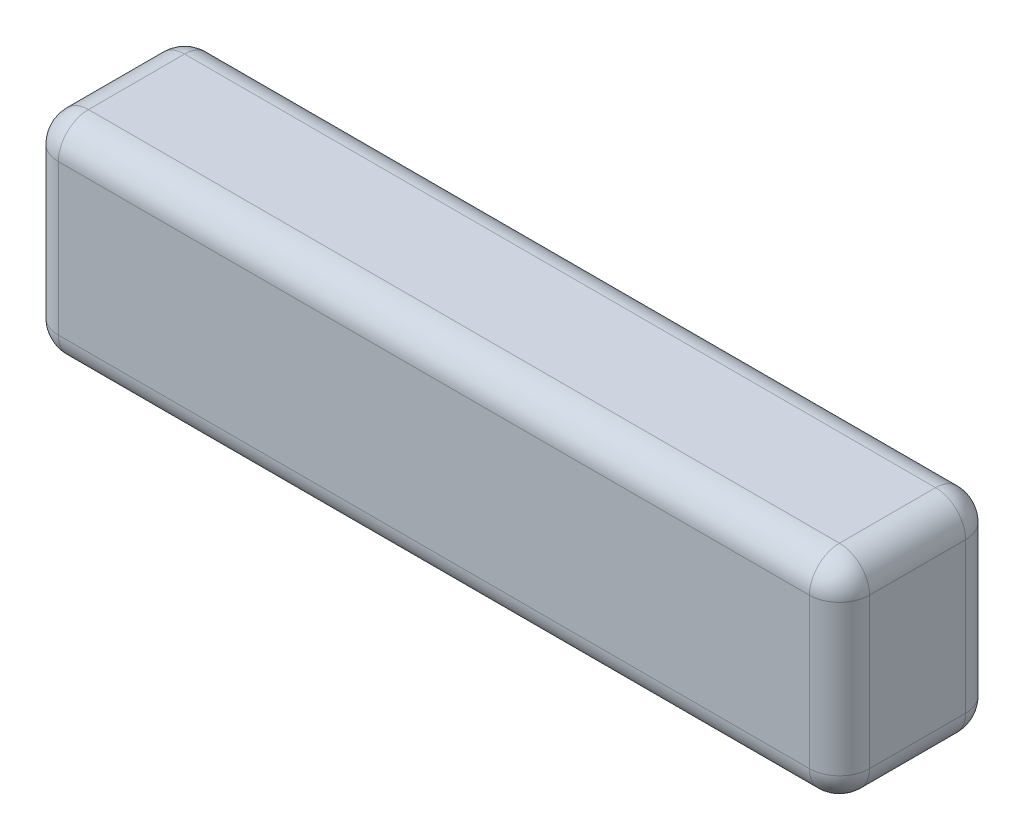
ISO-10303-21;
HEADER;
FILE_DESCRIPTION(('STEP AP214'),'2;1');
FILE_NAME('part.step','',(''),(''),'','','');
FILE_SCHEMA(('AUTOMOTIVE_DESIGN { 1 0 10303 214 1 1 1 1 }'));
ENDSEC;
DATA;
#1=APPLICATION_CONTEXT('core data for automotive mechanical design processes');
#2=APPLICATION_PROTOCOL_DEFINITION('international standard','automotive_design',2000,#1);
#3=PRODUCT_CONTEXT('',#1,'mechanical');
#4=PRODUCT('Part','Part','',(#3));
#5=PRODUCT_RELATED_PRODUCT_CATEGORY('part','',(#4));
#6=PRODUCT_DEFINITION_FORMATION('','',#4);
#7=PRODUCT_DEFINITION_CONTEXT('part definition',#1,'design');
#8=PRODUCT_DEFINITION('design','',#6,#7);
#9=PRODUCT_DEFINITION_SHAPE('','',#8);
#10=(LENGTH_UNIT() NAMED_UNIT(*) SI_UNIT(.MILLI.,.METRE.));
#11=(NAMED_UNIT(*) PLANE_ANGLE_UNIT() SI_UNIT($,.RADIAN.));
#12=(NAMED_UNIT(*) SI_UNIT($,.STERADIAN.) SOLID_ANGLE_UNIT());
#13=UNCERTAINTY_MEASURE_WITH_UNIT(LENGTH_MEASURE(1.E-05),#10,'distance_accuracy_value','');
#14=(GEOMETRIC_REPRESENTATION_CONTEXT(3) GLOBAL_UNCERTAINTY_ASSIGNED_CONTEXT((#13)) GLOBAL_UNIT_ASSIGNED_CONTEXT((#10,
#11,#12)) REPRESENTATION_CONTEXT('',''));
#15=CARTESIAN_POINT('',(0.,0.,0.));
#16=DIRECTION('',(0.,0.,1.));
#17=DIRECTION('',(1.,0.,0.));
#18=AXIS2_PLACEMENT_3D('',#15,#16,#17);
#19=CARTESIAN_POINT('',(135.,0.,26.));
#20=DIRECTION('',(0.,1.,0.));
#21=DIRECTION('',(-1.,0.,0.));
#22=AXIS2_PLACEMENT_3D('',#19,#20,#21);
#23=PLANE('',#22);
#24=DIRECTION('',(0.,0.,-1.));
#25=VECTOR('',#24,1.);
#26=CARTESIAN_POINT('',(5.00000000000003,0.,26.));
#27=LINE('',#26,#25);
#28=CARTESIAN_POINT('',(5.00000000000003,0.,21.));
#29=VERTEX_POINT('',#28);
#30=CARTESIAN_POINT('',(5.00000000000003,0.,5.));
#31=VERTEX_POINT('',#30);
#32=EDGE_CURVE('E189',#29,#31,#27,.T.);
#33=ORIENTED_EDGE('',*,*,#32,.T.);
#34=DIRECTION('',(1.,0.,0.));
#35=VECTOR('',#34,1.);
#36=CARTESIAN_POINT('',(135.,0.,5.));
#37=LINE('',#36,#35);
#38=CARTESIAN_POINT('',(130.,0.,5.));
#39=VERTEX_POINT('',#38);
#40=EDGE_CURVE('E191',#31,#39,#37,.T.);
#41=ORIENTED_EDGE('',*,*,#40,.T.);
#42=DIRECTION('',(0.,0.,-1.));
#43=VECTOR('',#42,1.);
#44=CARTESIAN_POINT('',(130.,0.,26.));
#45=LINE('',#44,#43);
#46=CARTESIAN_POINT('',(130.,0.,21.));
#47=VERTEX_POINT('',#46);
#48=EDGE_CURVE('E187',#39,#47,#45,.F.);
#49=ORIENTED_EDGE('',*,*,#48,.T.);
#50=DIRECTION('',(1.,0.,0.));
#51=VECTOR('',#50,1.);
#52=CARTESIAN_POINT('',(135.,0.,21.));
#53=LINE('',#52,#51);
#54=EDGE_CURVE('E185',#47,#29,#53,.F.);
#55=ORIENTED_EDGE('',*,*,#54,.T.);
#56=EDGE_LOOP('',(#33,#41,#49,#55));
#57=FACE_BOUND('',#56,.T.);
#58=ADVANCED_FACE('F32',(#57),#23,.F.);
#59=CARTESIAN_POINT('',(135.,35.,26.));
#60=DIRECTION('',(-1.,0.,0.));
#61=DIRECTION('',(0.,0.,1.));
#62=AXIS2_PLACEMENT_3D('',#59,#60,#61);
#63=PLANE('',#62);
#64=DIRECTION('',(0.,0.,-1.));
#65=VECTOR('',#64,1.);
#66=CARTESIAN_POINT('',(135.,5.00000000000001,26.));
#67=LINE('',#66,#65);
#68=CARTESIAN_POINT('',(135.,5.00000000000001,21.));
#69=VERTEX_POINT('',#68);
#70=CARTESIAN_POINT('',(135.,5.00000000000001,5.));
#71=VERTEX_POINT('',#70);
#72=EDGE_CURVE('E154',#69,#71,#67,.T.);
#73=ORIENTED_EDGE('',*,*,#72,.T.);
#74=DIRECTION('',(0.,1.,0.));
#75=VECTOR('',#74,1.);
#76=CARTESIAN_POINT('',(135.,35.,5.));
#77=LINE('',#76,#75);
#78=CARTESIAN_POINT('',(135.,30.,5.));
#79=VERTEX_POINT('',#78);
#80=EDGE_CURVE('E126',#71,#79,#77,.T.);
#81=ORIENTED_EDGE('',*,*,#80,.T.);
#82=DIRECTION('',(0.,0.,-1.));
#83=VECTOR('',#82,1.);
#84=CARTESIAN_POINT('',(135.,30.,26.));
#85=LINE('',#84,#83);
#86=CARTESIAN_POINT('',(135.,30.,21.));
#87=VERTEX_POINT('',#86);
#88=EDGE_CURVE('E144',#79,#87,#85,.F.);
#89=ORIENTED_EDGE('',*,*,#88,.T.);
#90=DIRECTION('',(0.,1.,0.));
#91=VECTOR('',#90,1.);
#92=CARTESIAN_POINT('',(135.,35.,21.));
#93=LINE('',#92,#91);
#94=EDGE_CURVE('E150',#87,#69,#93,.F.);
#95=ORIENTED_EDGE('',*,*,#94,.T.);
#96=EDGE_LOOP('',(#73,#81,#89,#95));
#97=FACE_BOUND('',#96,.T.);
#98=ADVANCED_FACE('F152',(#97),#63,.F.);
#99=CARTESIAN_POINT('',(0.,35.,26.));
#100=DIRECTION('',(0.,-1.,0.));
#101=DIRECTION('',(0.,0.,-1.));
#102=AXIS2_PLACEMENT_3D('',#99,#100,#101);
#103=PLANE('',#102);
#104=DIRECTION('',(0.,0.,-1.));
#105=VECTOR('',#104,1.);
#106=CARTESIAN_POINT('',(130.,35.,26.));
#107=LINE('',#106,#105);
#108=CARTESIAN_POINT('',(130.,35.,21.));
#109=VERTEX_POINT('',#108);
#110=CARTESIAN_POINT('',(130.,35.,5.));
#111=VERTEX_POINT('',#110);
#112=EDGE_CURVE('E167',#109,#111,#107,.T.);
#113=ORIENTED_EDGE('',*,*,#112,.T.);
#114=DIRECTION('',(-1.,0.,0.));
#115=VECTOR('',#114,1.);
#116=CARTESIAN_POINT('',(0.,35.,5.));
#117=LINE('',#116,#115);
#118=CARTESIAN_POINT('',(5.,35.,5.));
#119=VERTEX_POINT('',#118);
#120=EDGE_CURVE('E173',#111,#119,#117,.T.);
#121=ORIENTED_EDGE('',*,*,#120,.T.);
#122=DIRECTION('',(0.,0.,-1.));
#123=VECTOR('',#122,1.);
#124=CARTESIAN_POINT('',(5.,35.,26.));
#125=LINE('',#124,#123);
#126=CARTESIAN_POINT('',(5.,35.,21.));
#127=VERTEX_POINT('',#126);
#128=EDGE_CURVE('E171',#119,#127,#125,.F.);
#129=ORIENTED_EDGE('',*,*,#128,.T.);
#130=DIRECTION('',(-1.,0.,0.));
#131=VECTOR('',#130,1.);
#132=CARTESIAN_POINT('',(0.,35.,21.));
#133=LINE('',#132,#131);
#134=EDGE_CURVE('E169',#127,#109,#133,.F.);
#135=ORIENTED_EDGE('',*,*,#134,.T.);
#136=EDGE_LOOP('',(#113,#121,#129,#135));
#137=FACE_BOUND('',#136,.T.);
#138=ADVANCED_FACE('F289',(#137),#103,.F.);
#139=CARTESIAN_POINT('',(0.,0.,26.));
#140=DIRECTION('',(1.,0.,0.));
#141=DIRECTION('',(0.,0.,-1.));
#142=AXIS2_PLACEMENT_3D('',#139,#140,#141);
#143=PLANE('',#142);
#144=DIRECTION('',(0.,0.,-1.));
#145=VECTOR('',#144,1.);
#146=CARTESIAN_POINT('',(0.,30.,26.));
#147=LINE('',#146,#145);
#148=CARTESIAN_POINT('',(0.,30.,21.));
#149=VERTEX_POINT('',#148);
#150=CARTESIAN_POINT('',(0.,30.,5.));
#151=VERTEX_POINT('',#150);
#152=EDGE_CURVE('E176',#149,#151,#147,.T.);
#153=ORIENTED_EDGE('',*,*,#152,.T.);
#154=DIRECTION('',(0.,-1.,0.));
#155=VECTOR('',#154,1.);
#156=CARTESIAN_POINT('',(0.,0.,5.));
#157=LINE('',#156,#155);
#158=CARTESIAN_POINT('',(0.,5.,5.));
#159=VERTEX_POINT('',#158);
#160=EDGE_CURVE('E182',#151,#159,#157,.T.);
#161=ORIENTED_EDGE('',*,*,#160,.T.);
#162=DIRECTION('',(0.,0.,-1.));
#163=VECTOR('',#162,1.);
#164=CARTESIAN_POINT('',(0.,5.,26.));
#165=LINE('',#164,#163);
#166=CARTESIAN_POINT('',(0.,5.,21.));
#167=VERTEX_POINT('',#166);
#168=EDGE_CURVE('E180',#159,#167,#165,.F.);
#169=ORIENTED_EDGE('',*,*,#168,.T.);
#170=DIRECTION('',(0.,-1.,0.));
#171=VECTOR('',#170,1.);
#172=CARTESIAN_POINT('',(0.,0.,21.));
#173=LINE('',#172,#171);
#174=EDGE_CURVE('E178',#167,#149,#173,.F.);
#175=ORIENTED_EDGE('',*,*,#174,.T.);
#176=EDGE_LOOP('',(#153,#161,#169,#175));
#177=FACE_BOUND('',#176,.T.);
#178=ADVANCED_FACE('F352',(#177),#143,.F.);
#179=CARTESIAN_POINT('',(0.,0.,26.));
#180=DIRECTION('',(0.,0.,-1.));
#181=DIRECTION('',(-1.,0.,0.));
#182=AXIS2_PLACEMENT_3D('',#179,#180,#181);
#183=PLANE('',#182);
#184=DIRECTION('',(-1.,0.,0.));
#185=VECTOR('',#184,1.);
#186=CARTESIAN_POINT('',(0.,30.,26.));
#187=LINE('',#186,#185);
#188=CARTESIAN_POINT('',(130.,30.,26.));
#189=VERTEX_POINT('',#188);
#190=CARTESIAN_POINT('',(5.,30.,26.));
#191=VERTEX_POINT('',#190);
#192=EDGE_CURVE('E194',#189,#191,#187,.T.);
#193=ORIENTED_EDGE('',*,*,#192,.T.);
#194=DIRECTION('',(0.,-1.,0.));
#195=VECTOR('',#194,1.);
#196=CARTESIAN_POINT('',(5.,0.,26.));
#197=LINE('',#196,#195);
#198=CARTESIAN_POINT('',(5.,5.,26.));
#199=VERTEX_POINT('',#198);
#200=EDGE_CURVE('E11',#191,#199,#197,.T.);
#201=ORIENTED_EDGE('',*,*,#200,.T.);
#202=DIRECTION('',(1.,0.,0.));
#203=VECTOR('',#202,1.);
#204=CARTESIAN_POINT('',(0.,5.,26.));
#205=LINE('',#204,#203);
#206=CARTESIAN_POINT('',(130.,5.00000000000001,26.));
#207=VERTEX_POINT('',#206);
#208=EDGE_CURVE('E41',#199,#207,#205,.T.);
#209=ORIENTED_EDGE('',*,*,#208,.T.);
#210=DIRECTION('',(0.,1.,0.));
#211=VECTOR('',#210,1.);
#212=CARTESIAN_POINT('',(130.,0.,26.));
#213=LINE('',#212,#211);
#214=EDGE_CURVE('E196',#207,#189,#213,.T.);
#215=ORIENTED_EDGE('',*,*,#214,.T.);
#216=EDGE_LOOP('',(#193,#201,#209,#215));
#217=FACE_BOUND('',#216,.T.);
#218=ADVANCED_FACE('F362',(#217),#183,.F.);
#219=CARTESIAN_POINT('',(0.,0.,0.));
#220=DIRECTION('',(0.,0.,-1.));
#221=DIRECTION('',(-1.,0.,0.));
#222=AXIS2_PLACEMENT_3D('',#219,#220,#221);
#223=PLANE('',#222);
#224=DIRECTION('',(-1.,0.,0.));
#225=VECTOR('',#224,1.);
#226=CARTESIAN_POINT('',(135.,30.,0.));
#227=LINE('',#226,#225);
#228=CARTESIAN_POINT('',(5.,30.,0.));
#229=VERTEX_POINT('',#228);
#230=CARTESIAN_POINT('',(130.,30.,0.));
#231=VERTEX_POINT('',#230);
#232=EDGE_CURVE('E164',#229,#231,#227,.F.);
#233=ORIENTED_EDGE('',*,*,#232,.T.);
#234=DIRECTION('',(0.,1.,0.));
#235=VECTOR('',#234,1.);
#236=CARTESIAN_POINT('',(130.,0.,0.));
#237=LINE('',#236,#235);
#238=CARTESIAN_POINT('',(130.,5.00000000000001,0.));
#239=VERTEX_POINT('',#238);
#240=EDGE_CURVE('E128',#231,#239,#237,.F.);
#241=ORIENTED_EDGE('',*,*,#240,.T.);
#242=DIRECTION('',(1.,0.,0.));
#243=VECTOR('',#242,1.);
#244=CARTESIAN_POINT('',(0.,5.,0.));
#245=LINE('',#244,#243);
#246=CARTESIAN_POINT('',(5.,5.,0.));
#247=VERTEX_POINT('',#246);
#248=EDGE_CURVE('E156',#239,#247,#245,.F.);
#249=ORIENTED_EDGE('',*,*,#248,.T.);
#250=DIRECTION('',(0.,-1.,0.));
#251=VECTOR('',#250,1.);
#252=CARTESIAN_POINT('',(5.,35.,0.));
#253=LINE('',#252,#251);
#254=EDGE_CURVE('E158',#247,#229,#253,.F.);
#255=ORIENTED_EDGE('',*,*,#254,.T.);
#256=EDGE_LOOP('',(#233,#241,#249,#255));
#257=FACE_BOUND('',#256,.T.);
#258=ADVANCED_FACE('F364',(#257),#223,.T.);
#259=CARTESIAN_POINT('',(5.,0.,21.));
#260=DIRECTION('',(0.,-1.,0.));
#261=DIRECTION('',(0.,0.,-1.));
#262=AXIS2_PLACEMENT_3D('',#259,#260,#261);
#263=CYLINDRICAL_SURFACE('',#262,5.);
#264=CARTESIAN_POINT('',(5.,5.,21.));
#265=DIRECTION('',(0.,-1.,0.));
#266=DIRECTION('',(0.,0.,-1.));
#267=AXIS2_PLACEMENT_3D('',#264,#265,#266);
#268=CIRCLE('',#267,5.);
#269=EDGE_CURVE('E36',#199,#167,#268,.T.);
#270=ORIENTED_EDGE('',*,*,#269,.F.);
#271=ORIENTED_EDGE('',*,*,#200,.F.);
#272=CARTESIAN_POINT('',(5.,30.,21.));
#273=DIRECTION('',(0.,1.,0.));
#274=DIRECTION('',(0.,0.,1.));
#275=AXIS2_PLACEMENT_3D('',#272,#273,#274);
#276=CIRCLE('',#275,5.);
#277=EDGE_CURVE('E247',#149,#191,#276,.T.);
#278=ORIENTED_EDGE('',*,*,#277,.F.);
#279=ORIENTED_EDGE('',*,*,#174,.F.);
#280=EDGE_LOOP('',(#270,#271,#278,#279));
#281=FACE_BOUND('',#280,.T.);
#282=ADVANCED_FACE('F34',(#281),#263,.T.);
#283=CARTESIAN_POINT('',(5.,5.,21.));
#284=DIRECTION('',(0.,0.,1.));
#285=DIRECTION('',(1.,0.,0.));
#286=AXIS2_PLACEMENT_3D('',#283,#284,#285);
#287=SPHERICAL_SURFACE('',#286,5.);
#288=CARTESIAN_POINT('',(5.00000000000003,5.,21.));
#289=DIRECTION('',(-1.,0.,0.));
#290=DIRECTION('',(0.,0.,1.));
#291=AXIS2_PLACEMENT_3D('',#288,#289,#290);
#292=CIRCLE('',#291,5.);
#293=EDGE_CURVE('E243',#199,#29,#292,.F.);
#294=ORIENTED_EDGE('',*,*,#293,.F.);
#295=ORIENTED_EDGE('',*,*,#269,.T.);
#296=CARTESIAN_POINT('',(5.,5.,21.));
#297=DIRECTION('',(0.,0.,1.));
#298=DIRECTION('',(1.,0.,0.));
#299=AXIS2_PLACEMENT_3D('',#296,#297,#298);
#300=CIRCLE('',#299,5.);
#301=EDGE_CURVE('E245',#29,#167,#300,.F.);
#302=ORIENTED_EDGE('',*,*,#301,.F.);
#303=EDGE_LOOP('',(#294,#295,#302));
#304=FACE_BOUND('',#303,.T.);
#305=ADVANCED_FACE('F257',(#304),#287,.T.);
#306=CARTESIAN_POINT('',(5.,30.,21.));
#307=DIRECTION('',(0.,0.,1.));
#308=DIRECTION('',(1.,0.,0.));
#309=AXIS2_PLACEMENT_3D('',#306,#307,#308);
#310=SPHERICAL_SURFACE('',#309,5.);
#311=CARTESIAN_POINT('',(5.,30.,21.));
#312=DIRECTION('',(0.,0.,1.));
#313=DIRECTION('',(1.,0.,0.));
#314=AXIS2_PLACEMENT_3D('',#311,#312,#313);
#315=CIRCLE('',#314,5.);
#316=EDGE_CURVE('E237',#149,#127,#315,.F.);
#317=ORIENTED_EDGE('',*,*,#316,.F.);
#318=ORIENTED_EDGE('',*,*,#277,.T.);
#319=CARTESIAN_POINT('',(5.,30.,21.));
#320=DIRECTION('',(-1.,0.,0.));
#321=DIRECTION('',(0.,0.,1.));
#322=AXIS2_PLACEMENT_3D('',#319,#320,#321);
#323=CIRCLE('',#322,5.);
#324=EDGE_CURVE('E240',#127,#191,#323,.F.);
#325=ORIENTED_EDGE('',*,*,#324,.F.);
#326=EDGE_LOOP('',(#317,#318,#325));
#327=FACE_BOUND('',#326,.T.);
#328=ADVANCED_FACE('F282',(#327),#310,.T.);
#329=CARTESIAN_POINT('',(5.00000000000003,5.,26.));
#330=DIRECTION('',(0.,0.,-1.));
#331=DIRECTION('',(-1.,0.,0.));
#332=AXIS2_PLACEMENT_3D('',#329,#330,#331);
#333=CYLINDRICAL_SURFACE('',#332,5.);
#334=ORIENTED_EDGE('',*,*,#301,.T.);
#335=ORIENTED_EDGE('',*,*,#168,.F.);
#336=CARTESIAN_POINT('',(5.00000000000003,5.,5.));
#337=DIRECTION('',(0.,0.,-1.));
#338=DIRECTION('',(-1.,0.,0.));
#339=AXIS2_PLACEMENT_3D('',#336,#337,#338);
#340=CIRCLE('',#339,5.);
#341=EDGE_CURVE('E232',#31,#159,#340,.T.);
#342=ORIENTED_EDGE('',*,*,#341,.F.);
#343=ORIENTED_EDGE('',*,*,#32,.F.);
#344=EDGE_LOOP('',(#334,#335,#342,#343));
#345=FACE_BOUND('',#344,.T.);
#346=ADVANCED_FACE('F264',(#345),#333,.T.);
#347=CARTESIAN_POINT('',(0.,5.,21.));
#348=DIRECTION('',(1.,0.,0.));
#349=DIRECTION('',(0.,1.,0.));
#350=AXIS2_PLACEMENT_3D('',#347,#348,#349);
#351=CYLINDRICAL_SURFACE('',#350,5.);
#352=ORIENTED_EDGE('',*,*,#293,.T.);
#353=ORIENTED_EDGE('',*,*,#54,.F.);
#354=CARTESIAN_POINT('',(130.,5.00000000000001,21.));
#355=DIRECTION('',(1.,0.,0.));
#356=DIRECTION('',(0.,0.,-1.));
#357=AXIS2_PLACEMENT_3D('',#354,#355,#356);
#358=CIRCLE('',#357,5.);
#359=EDGE_CURVE('E229',#207,#47,#358,.T.);
#360=ORIENTED_EDGE('',*,*,#359,.F.);
#361=ORIENTED_EDGE('',*,*,#208,.F.);
#362=EDGE_LOOP('',(#352,#353,#360,#361));
#363=FACE_BOUND('',#362,.T.);
#364=ADVANCED_FACE('F271',(#363),#351,.T.);
#365=CARTESIAN_POINT('',(130.,0.,21.));
#366=DIRECTION('',(0.,1.,0.));
#367=DIRECTION('',(0.,0.,1.));
#368=AXIS2_PLACEMENT_3D('',#365,#366,#367);
#369=CYLINDRICAL_SURFACE('',#368,5.);
#370=CARTESIAN_POINT('',(130.,30.,21.));
#371=DIRECTION('',(0.,1.,0.));
#372=DIRECTION('',(0.,0.,1.));
#373=AXIS2_PLACEMENT_3D('',#370,#371,#372);
#374=CIRCLE('',#373,5.);
#375=EDGE_CURVE('E223',#189,#87,#374,.T.);
#376=ORIENTED_EDGE('',*,*,#375,.F.);
#377=ORIENTED_EDGE('',*,*,#214,.F.);
#378=CARTESIAN_POINT('',(130.,5.00000000000001,21.));
#379=DIRECTION('',(0.,-1.,0.));
#380=DIRECTION('',(0.,0.,-1.));
#381=AXIS2_PLACEMENT_3D('',#378,#379,#380);
#382=CIRCLE('',#381,5.);
#383=EDGE_CURVE('E226',#69,#207,#382,.T.);
#384=ORIENTED_EDGE('',*,*,#383,.F.);
#385=ORIENTED_EDGE('',*,*,#94,.F.);
#386=EDGE_LOOP('',(#376,#377,#384,#385));
#387=FACE_BOUND('',#386,.T.);
#388=ADVANCED_FACE('F273',(#387),#369,.T.);
#389=CARTESIAN_POINT('',(0.,30.,21.));
#390=DIRECTION('',(-1.,0.,0.));
#391=DIRECTION('',(0.,0.,1.));
#392=AXIS2_PLACEMENT_3D('',#389,#390,#391);
#393=CYLINDRICAL_SURFACE('',#392,5.);
#394=ORIENTED_EDGE('',*,*,#324,.T.);
#395=ORIENTED_EDGE('',*,*,#192,.F.);
#396=CARTESIAN_POINT('',(130.,30.,21.));
#397=DIRECTION('',(1.,0.,0.));
#398=DIRECTION('',(0.,0.,-1.));
#399=AXIS2_PLACEMENT_3D('',#396,#397,#398);
#400=CIRCLE('',#399,5.);
#401=EDGE_CURVE('E220',#109,#189,#400,.T.);
#402=ORIENTED_EDGE('',*,*,#401,.F.);
#403=ORIENTED_EDGE('',*,*,#134,.F.);
#404=EDGE_LOOP('',(#394,#395,#402,#403));
#405=FACE_BOUND('',#404,.T.);
#406=ADVANCED_FACE('F279',(#405),#393,.T.);
#407=CARTESIAN_POINT('',(5.,30.,26.));
#408=DIRECTION('',(0.,0.,-1.));
#409=DIRECTION('',(-1.,0.,0.));
#410=AXIS2_PLACEMENT_3D('',#407,#408,#409);
#411=CYLINDRICAL_SURFACE('',#410,5.);
#412=ORIENTED_EDGE('',*,*,#316,.T.);
#413=ORIENTED_EDGE('',*,*,#128,.F.);
#414=CARTESIAN_POINT('',(5.,30.,5.));
#415=DIRECTION('',(0.,0.,-1.));
#416=DIRECTION('',(-1.,0.,0.));
#417=AXIS2_PLACEMENT_3D('',#414,#415,#416);
#418=CIRCLE('',#417,5.);
#419=EDGE_CURVE('E217',#151,#119,#418,.T.);
#420=ORIENTED_EDGE('',*,*,#419,.F.);
#421=ORIENTED_EDGE('',*,*,#152,.F.);
#422=EDGE_LOOP('',(#412,#413,#420,#421));
#423=FACE_BOUND('',#422,.T.);
#424=ADVANCED_FACE('F334',(#423),#411,.T.);
#425=CARTESIAN_POINT('',(5.,0.,5.));
#426=DIRECTION('',(0.,1.,0.));
#427=DIRECTION('',(0.,0.,1.));
#428=AXIS2_PLACEMENT_3D('',#425,#426,#427);
#429=CYLINDRICAL_SURFACE('',#428,5.);
#430=CARTESIAN_POINT('',(5.,5.,5.));
#431=DIRECTION('',(0.,-1.,0.));
#432=DIRECTION('',(0.,0.,-1.));
#433=AXIS2_PLACEMENT_3D('',#430,#431,#432);
#434=CIRCLE('',#433,5.);
#435=EDGE_CURVE('E234',#159,#247,#434,.T.);
#436=ORIENTED_EDGE('',*,*,#435,.F.);
#437=ORIENTED_EDGE('',*,*,#160,.F.);
#438=CARTESIAN_POINT('',(5.,30.,5.));
#439=DIRECTION('',(0.,1.,0.));
#440=DIRECTION('',(0.,0.,1.));
#441=AXIS2_PLACEMENT_3D('',#438,#439,#440);
#442=CIRCLE('',#441,5.);
#443=EDGE_CURVE('E214',#229,#151,#442,.T.);
#444=ORIENTED_EDGE('',*,*,#443,.F.);
#445=ORIENTED_EDGE('',*,*,#254,.F.);
#446=EDGE_LOOP('',(#436,#437,#444,#445));
#447=FACE_BOUND('',#446,.T.);
#448=ADVANCED_FACE('F330',(#447),#429,.T.);
#449=CARTESIAN_POINT('',(5.,5.,5.));
#450=DIRECTION('',(0.,0.,1.));
#451=DIRECTION('',(1.,0.,0.));
#452=AXIS2_PLACEMENT_3D('',#449,#450,#451);
#453=SPHERICAL_SURFACE('',#452,5.);
#454=ORIENTED_EDGE('',*,*,#341,.T.);
#455=ORIENTED_EDGE('',*,*,#435,.T.);
#456=CARTESIAN_POINT('',(5.,5.,5.));
#457=DIRECTION('',(-1.,0.,0.));
#458=DIRECTION('',(0.,-1.,0.));
#459=AXIS2_PLACEMENT_3D('',#456,#457,#458);
#460=CIRCLE('',#459,5.);
#461=EDGE_CURVE('E211',#31,#247,#460,.F.);
#462=ORIENTED_EDGE('',*,*,#461,.F.);
#463=EDGE_LOOP('',(#454,#455,#462));
#464=FACE_BOUND('',#463,.T.);
#465=ADVANCED_FACE('F326',(#464),#453,.T.);
#466=CARTESIAN_POINT('',(130.,5.00000000000001,21.));
#467=DIRECTION('',(0.,0.,1.));
#468=DIRECTION('',(1.,0.,0.));
#469=AXIS2_PLACEMENT_3D('',#466,#467,#468);
#470=SPHERICAL_SURFACE('',#469,5.);
#471=ORIENTED_EDGE('',*,*,#383,.T.);
#472=ORIENTED_EDGE('',*,*,#359,.T.);
#473=CARTESIAN_POINT('',(130.,5.00000000000001,21.));
#474=DIRECTION('',(0.,0.,1.));
#475=DIRECTION('',(1.,0.,0.));
#476=AXIS2_PLACEMENT_3D('',#473,#474,#475);
#477=CIRCLE('',#476,5.);
#478=EDGE_CURVE('E208',#69,#47,#477,.F.);
#479=ORIENTED_EDGE('',*,*,#478,.F.);
#480=EDGE_LOOP('',(#471,#472,#479));
#481=FACE_BOUND('',#480,.T.);
#482=ADVANCED_FACE('F322',(#481),#470,.T.);
#483=CARTESIAN_POINT('',(130.,30.,21.));
#484=DIRECTION('',(0.,0.,1.));
#485=DIRECTION('',(1.,0.,0.));
#486=AXIS2_PLACEMENT_3D('',#483,#484,#485);
#487=SPHERICAL_SURFACE('',#486,5.);
#488=ORIENTED_EDGE('',*,*,#401,.T.);
#489=ORIENTED_EDGE('',*,*,#375,.T.);
#490=CARTESIAN_POINT('',(130.,30.,21.));
#491=DIRECTION('',(0.,0.,1.));
#492=DIRECTION('',(1.,0.,0.));
#493=AXIS2_PLACEMENT_3D('',#490,#491,#492);
#494=CIRCLE('',#493,5.);
#495=EDGE_CURVE('E147',#109,#87,#494,.F.);
#496=ORIENTED_EDGE('',*,*,#495,.F.);
#497=EDGE_LOOP('',(#488,#489,#496));
#498=FACE_BOUND('',#497,.T.);
#499=ADVANCED_FACE('F318',(#498),#487,.T.);
#500=CARTESIAN_POINT('',(5.,30.,5.));
#501=DIRECTION('',(0.,0.,1.));
#502=DIRECTION('',(1.,0.,0.));
#503=AXIS2_PLACEMENT_3D('',#500,#501,#502);
#504=SPHERICAL_SURFACE('',#503,5.);
#505=ORIENTED_EDGE('',*,*,#443,.T.);
#506=ORIENTED_EDGE('',*,*,#419,.T.);
#507=CARTESIAN_POINT('',(5.,30.,5.));
#508=DIRECTION('',(-1.,0.,0.));
#509=DIRECTION('',(0.,0.,1.));
#510=AXIS2_PLACEMENT_3D('',#507,#508,#509);
#511=CIRCLE('',#510,5.);
#512=EDGE_CURVE('E205',#229,#119,#511,.F.);
#513=ORIENTED_EDGE('',*,*,#512,.F.);
#514=EDGE_LOOP('',(#505,#506,#513));
#515=FACE_BOUND('',#514,.T.);
#516=ADVANCED_FACE('F314',(#515),#504,.T.);
#517=CARTESIAN_POINT('',(135.,5.00000000000001,5.));
#518=DIRECTION('',(-1.,0.,0.));
#519=DIRECTION('',(0.,-1.,0.));
#520=AXIS2_PLACEMENT_3D('',#517,#518,#519);
#521=CYLINDRICAL_SURFACE('',#520,5.);
#522=ORIENTED_EDGE('',*,*,#461,.T.);
#523=ORIENTED_EDGE('',*,*,#248,.F.);
#524=CARTESIAN_POINT('',(130.,5.00000000000001,5.));
#525=DIRECTION('',(1.,0.,0.));
#526=DIRECTION('',(0.,0.,-1.));
#527=AXIS2_PLACEMENT_3D('',#524,#525,#526);
#528=CIRCLE('',#527,5.);
#529=EDGE_CURVE('E202',#39,#239,#528,.T.);
#530=ORIENTED_EDGE('',*,*,#529,.F.);
#531=ORIENTED_EDGE('',*,*,#40,.F.);
#532=EDGE_LOOP('',(#522,#523,#530,#531));
#533=FACE_BOUND('',#532,.T.);
#534=ADVANCED_FACE('F310',(#533),#521,.T.);
#535=CARTESIAN_POINT('',(130.,5.00000000000001,26.));
#536=DIRECTION('',(0.,0.,-1.));
#537=DIRECTION('',(-1.,0.,0.));
#538=AXIS2_PLACEMENT_3D('',#535,#536,#537);
#539=CYLINDRICAL_SURFACE('',#538,5.);
#540=ORIENTED_EDGE('',*,*,#478,.T.);
#541=ORIENTED_EDGE('',*,*,#48,.F.);
#542=CARTESIAN_POINT('',(130.,5.00000000000001,5.));
#543=DIRECTION('',(0.,0.,-1.));
#544=DIRECTION('',(-1.,0.,0.));
#545=AXIS2_PLACEMENT_3D('',#542,#543,#544);
#546=CIRCLE('',#545,5.);
#547=EDGE_CURVE('E141',#71,#39,#546,.T.);
#548=ORIENTED_EDGE('',*,*,#547,.F.);
#549=ORIENTED_EDGE('',*,*,#72,.F.);
#550=EDGE_LOOP('',(#540,#541,#548,#549));
#551=FACE_BOUND('',#550,.T.);
#552=ADVANCED_FACE('F307',(#551),#539,.T.);
#553=CARTESIAN_POINT('',(130.,30.,26.));
#554=DIRECTION('',(0.,0.,-1.));
#555=DIRECTION('',(-1.,0.,0.));
#556=AXIS2_PLACEMENT_3D('',#553,#554,#555);
#557=CYLINDRICAL_SURFACE('',#556,5.);
#558=ORIENTED_EDGE('',*,*,#495,.T.);
#559=ORIENTED_EDGE('',*,*,#88,.F.);
#560=CARTESIAN_POINT('',(130.,30.,5.));
#561=DIRECTION('',(0.,0.,-1.));
#562=DIRECTION('',(-1.,0.,0.));
#563=AXIS2_PLACEMENT_3D('',#560,#561,#562);
#564=CIRCLE('',#563,5.);
#565=EDGE_CURVE('E134',#111,#79,#564,.T.);
#566=ORIENTED_EDGE('',*,*,#565,.F.);
#567=ORIENTED_EDGE('',*,*,#112,.F.);
#568=EDGE_LOOP('',(#558,#559,#566,#567));
#569=FACE_BOUND('',#568,.T.);
#570=ADVANCED_FACE('F145',(#569),#557,.T.);
#571=CARTESIAN_POINT('',(0.,30.,5.));
#572=DIRECTION('',(1.,0.,0.));
#573=DIRECTION('',(0.,0.,-1.));
#574=AXIS2_PLACEMENT_3D('',#571,#572,#573);
#575=CYLINDRICAL_SURFACE('',#574,5.);
#576=ORIENTED_EDGE('',*,*,#512,.T.);
#577=ORIENTED_EDGE('',*,*,#120,.F.);
#578=CARTESIAN_POINT('',(130.,30.,5.));
#579=DIRECTION('',(1.,0.,0.));
#580=DIRECTION('',(0.,1.,0.));
#581=AXIS2_PLACEMENT_3D('',#578,#579,#580);
#582=CIRCLE('',#581,5.);
#583=EDGE_CURVE('E138',#231,#111,#582,.T.);
#584=ORIENTED_EDGE('',*,*,#583,.F.);
#585=ORIENTED_EDGE('',*,*,#232,.F.);
#586=EDGE_LOOP('',(#576,#577,#584,#585));
#587=FACE_BOUND('',#586,.T.);
#588=ADVANCED_FACE('F300',(#587),#575,.T.);
#589=CARTESIAN_POINT('',(130.,5.00000000000001,5.));
#590=DIRECTION('',(0.,0.,1.));
#591=DIRECTION('',(1.,0.,0.));
#592=AXIS2_PLACEMENT_3D('',#589,#590,#591);
#593=SPHERICAL_SURFACE('',#592,5.);
#594=ORIENTED_EDGE('',*,*,#547,.T.);
#595=ORIENTED_EDGE('',*,*,#529,.T.);
#596=CARTESIAN_POINT('',(130.,5.00000000000001,5.));
#597=DIRECTION('',(0.,-1.,0.));
#598=DIRECTION('',(0.,0.,-1.));
#599=AXIS2_PLACEMENT_3D('',#596,#597,#598);
#600=CIRCLE('',#599,5.);
#601=EDGE_CURVE('E131',#71,#239,#600,.F.);
#602=ORIENTED_EDGE('',*,*,#601,.F.);
#603=EDGE_LOOP('',(#594,#595,#602));
#604=FACE_BOUND('',#603,.T.);
#605=ADVANCED_FACE('F297',(#604),#593,.T.);
#606=CARTESIAN_POINT('',(130.,30.,5.));
#607=DIRECTION('',(0.,0.,1.));
#608=DIRECTION('',(1.,0.,0.));
#609=AXIS2_PLACEMENT_3D('',#606,#607,#608);
#610=SPHERICAL_SURFACE('',#609,5.);
#611=ORIENTED_EDGE('',*,*,#583,.T.);
#612=ORIENTED_EDGE('',*,*,#565,.T.);
#613=CARTESIAN_POINT('',(130.,30.,5.));
#614=DIRECTION('',(0.,1.,0.));
#615=DIRECTION('',(0.,0.,1.));
#616=AXIS2_PLACEMENT_3D('',#613,#614,#615);
#617=CIRCLE('',#616,5.);
#618=EDGE_CURVE('E122',#231,#79,#617,.F.);
#619=ORIENTED_EDGE('',*,*,#618,.F.);
#620=EDGE_LOOP('',(#611,#612,#619));
#621=FACE_BOUND('',#620,.T.);
#622=ADVANCED_FACE('F136',(#621),#610,.T.);
#623=CARTESIAN_POINT('',(130.,35.,5.));
#624=DIRECTION('',(0.,-1.,0.));
#625=DIRECTION('',(0.,0.,-1.));
#626=AXIS2_PLACEMENT_3D('',#623,#624,#625);
#627=CYLINDRICAL_SURFACE('',#626,5.);
#628=ORIENTED_EDGE('',*,*,#601,.T.);
#629=ORIENTED_EDGE('',*,*,#240,.F.);
#630=ORIENTED_EDGE('',*,*,#618,.T.);
#631=ORIENTED_EDGE('',*,*,#80,.F.);
#632=EDGE_LOOP('',(#628,#629,#630,#631));
#633=FACE_BOUND('',#632,.T.);
#634=ADVANCED_FACE('F124',(#633),#627,.T.);
#635=CLOSED_SHELL('',(#58,#98,#138,#178,#218,#258,#282,#305,#328,#346,#364,#388,#406,#424,#448,
#465,#482,#499,#516,#534,#552,#570,#588,#605,#622,#634));
#636=MANIFOLD_SOLID_BREP('B2',#635);
#637=ADVANCED_BREP_SHAPE_REPRESENTATION('',(#18,#636),#14);
#638=SHAPE_DEFINITION_REPRESENTATION(#9,#637);
ENDSEC;
END-ISO-10303-21;
